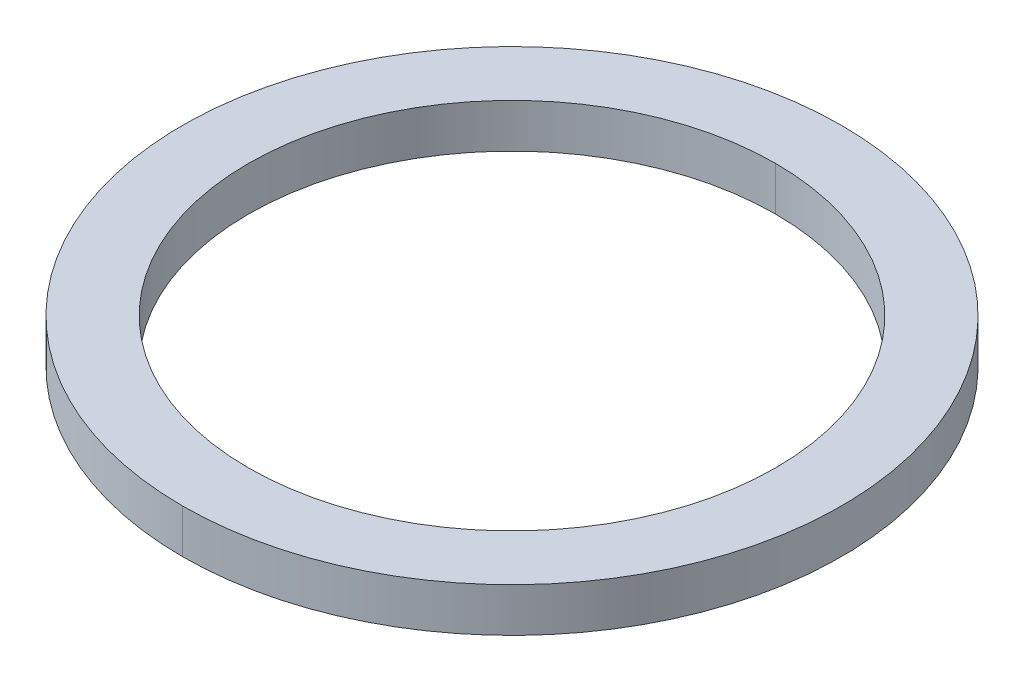
ISO-10303-21;
HEADER;
FILE_DESCRIPTION(('STEP AP214'),'2;1');
FILE_NAME('part.step','',(''),(''),'','','');
FILE_SCHEMA(('AUTOMOTIVE_DESIGN { 1 0 10303 214 1 1 1 1 }'));
ENDSEC;
DATA;
#1=APPLICATION_CONTEXT('core data for automotive mechanical design processes');
#2=APPLICATION_PROTOCOL_DEFINITION('international standard','automotive_design',2000,#1);
#3=PRODUCT_CONTEXT('',#1,'mechanical');
#4=PRODUCT('Part','Part','',(#3));
#5=PRODUCT_RELATED_PRODUCT_CATEGORY('part','',(#4));
#6=PRODUCT_DEFINITION_FORMATION('','',#4);
#7=PRODUCT_DEFINITION_CONTEXT('part definition',#1,'design');
#8=PRODUCT_DEFINITION('design','',#6,#7);
#9=PRODUCT_DEFINITION_SHAPE('','',#8);
#10=(LENGTH_UNIT() NAMED_UNIT(*) SI_UNIT(.MILLI.,.METRE.));
#11=(NAMED_UNIT(*) PLANE_ANGLE_UNIT() SI_UNIT($,.RADIAN.));
#12=(NAMED_UNIT(*) SI_UNIT($,.STERADIAN.) SOLID_ANGLE_UNIT());
#13=UNCERTAINTY_MEASURE_WITH_UNIT(LENGTH_MEASURE(1.E-05),#10,'distance_accuracy_value','');
#14=(GEOMETRIC_REPRESENTATION_CONTEXT(3) GLOBAL_UNCERTAINTY_ASSIGNED_CONTEXT((#13)) GLOBAL_UNIT_ASSIGNED_CONTEXT((#10,
#11,#12)) REPRESENTATION_CONTEXT('',''));
#15=CARTESIAN_POINT('',(0.,0.,0.));
#16=DIRECTION('',(0.,0.,1.));
#17=DIRECTION('',(1.,0.,0.));
#18=AXIS2_PLACEMENT_3D('',#15,#16,#17);
#19=CARTESIAN_POINT('',(0.,1.,0.));
#20=DIRECTION('',(0.,-1.,0.));
#21=DIRECTION('',(0.,0.,-1.));
#22=AXIS2_PLACEMENT_3D('',#19,#20,#21);
#23=CYLINDRICAL_SURFACE('',#22,6.);
#24=DIRECTION('',(0.,-1.,0.));
#25=VECTOR('',#24,1.);
#26=CARTESIAN_POINT('',(0.,1.,6.));
#27=LINE('',#26,#25);
#28=CARTESIAN_POINT('',(0.,1.,6.));
#29=VERTEX_POINT('',#28);
#30=CARTESIAN_POINT('',(0.,0.,6.));
#31=VERTEX_POINT('',#30);
#32=EDGE_CURVE('E83',#29,#31,#27,.T.);
#33=ORIENTED_EDGE('',*,*,#32,.F.);
#34=CARTESIAN_POINT('',(0.,1.,0.));
#35=DIRECTION('',(0.,1.,0.));
#36=DIRECTION('',(0.,0.,1.));
#37=AXIS2_PLACEMENT_3D('',#34,#35,#36);
#38=CIRCLE('',#37,6.);
#39=CARTESIAN_POINT('',(0.,1.,-6.));
#40=VERTEX_POINT('',#39);
#41=EDGE_CURVE('E71',#29,#40,#38,.T.);
#42=ORIENTED_EDGE('',*,*,#41,.T.);
#43=DIRECTION('',(0.,-1.,0.));
#44=VECTOR('',#43,1.);
#45=CARTESIAN_POINT('',(0.,1.,-6.));
#46=LINE('',#45,#44);
#47=CARTESIAN_POINT('',(0.,0.,-6.));
#48=VERTEX_POINT('',#47);
#49=EDGE_CURVE('E91',#40,#48,#46,.T.);
#50=ORIENTED_EDGE('',*,*,#49,.T.);
#51=CARTESIAN_POINT('',(0.,0.,0.));
#52=DIRECTION('',(0.,1.,0.));
#53=DIRECTION('',(0.,0.,1.));
#54=AXIS2_PLACEMENT_3D('',#51,#52,#53);
#55=CIRCLE('',#54,6.);
#56=EDGE_CURVE('E10',#31,#48,#55,.T.);
#57=ORIENTED_EDGE('',*,*,#56,.F.);
#58=EDGE_LOOP('',(#33,#42,#50,#57));
#59=FACE_BOUND('',#58,.T.);
#60=ADVANCED_FACE('F16',(#59),#23,.F.);
#61=CARTESIAN_POINT('',(0.,1.,0.));
#62=DIRECTION('',(0.,-1.,0.));
#63=DIRECTION('',(0.,0.,-1.));
#64=AXIS2_PLACEMENT_3D('',#61,#62,#63);
#65=CYLINDRICAL_SURFACE('',#64,7.5);
#66=DIRECTION('',(0.,-1.,0.));
#67=VECTOR('',#66,1.);
#68=CARTESIAN_POINT('',(0.,1.,7.5));
#69=LINE('',#68,#67);
#70=CARTESIAN_POINT('',(0.,1.,7.5));
#71=VERTEX_POINT('',#70);
#72=CARTESIAN_POINT('',(0.,0.,7.5));
#73=VERTEX_POINT('',#72);
#74=EDGE_CURVE('E106',#71,#73,#69,.T.);
#75=ORIENTED_EDGE('',*,*,#74,.F.);
#76=CARTESIAN_POINT('',(0.,1.,0.));
#77=DIRECTION('',(0.,1.,0.));
#78=DIRECTION('',(0.,0.,1.));
#79=AXIS2_PLACEMENT_3D('',#76,#77,#78);
#80=CIRCLE('',#79,7.5);
#81=CARTESIAN_POINT('',(0.,1.,-7.5));
#82=VERTEX_POINT('',#81);
#83=EDGE_CURVE('E19',#82,#71,#80,.T.);
#84=ORIENTED_EDGE('',*,*,#83,.F.);
#85=DIRECTION('',(0.,-1.,0.));
#86=VECTOR('',#85,1.);
#87=CARTESIAN_POINT('',(0.,1.,-7.5));
#88=LINE('',#87,#86);
#89=CARTESIAN_POINT('',(0.,0.,-7.5));
#90=VERTEX_POINT('',#89);
#91=EDGE_CURVE('E114',#82,#90,#88,.T.);
#92=ORIENTED_EDGE('',*,*,#91,.T.);
#93=CARTESIAN_POINT('',(0.,0.,0.));
#94=DIRECTION('',(0.,1.,0.));
#95=DIRECTION('',(0.,0.,1.));
#96=AXIS2_PLACEMENT_3D('',#93,#94,#95);
#97=CIRCLE('',#96,7.5);
#98=EDGE_CURVE('E25',#90,#73,#97,.T.);
#99=ORIENTED_EDGE('',*,*,#98,.T.);
#100=EDGE_LOOP('',(#75,#84,#92,#99));
#101=FACE_BOUND('',#100,.T.);
#102=ADVANCED_FACE('F124',(#101),#65,.T.);
#103=CARTESIAN_POINT('',(0.,0.,0.));
#104=DIRECTION('',(0.,1.,0.));
#105=DIRECTION('',(1.,0.,0.));
#106=AXIS2_PLACEMENT_3D('',#103,#104,#105);
#107=PLANE('',#106);
#108=CARTESIAN_POINT('',(0.,0.,0.));
#109=DIRECTION('',(0.,1.,0.));
#110=DIRECTION('',(0.,0.,1.));
#111=AXIS2_PLACEMENT_3D('',#108,#109,#110);
#112=CIRCLE('',#111,6.);
#113=EDGE_CURVE('E88',#48,#31,#112,.T.);
#114=ORIENTED_EDGE('',*,*,#113,.T.);
#115=ORIENTED_EDGE('',*,*,#56,.T.);
#116=EDGE_LOOP('',(#114,#115));
#117=FACE_BOUND('',#116,.T.);
#118=ORIENTED_EDGE('',*,*,#98,.F.);
#119=CARTESIAN_POINT('',(0.,0.,0.));
#120=DIRECTION('',(0.,1.,0.));
#121=DIRECTION('',(0.,0.,1.));
#122=AXIS2_PLACEMENT_3D('',#119,#120,#121);
#123=CIRCLE('',#122,7.5);
#124=EDGE_CURVE('E111',#73,#90,#123,.T.);
#125=ORIENTED_EDGE('',*,*,#124,.F.);
#126=EDGE_LOOP('',(#118,#125));
#127=FACE_BOUND('',#126,.T.);
#128=ADVANCED_FACE('F127',(#117,#127),#107,.F.);
#129=CARTESIAN_POINT('',(0.,1.,0.));
#130=DIRECTION('',(0.,1.,0.));
#131=DIRECTION('',(1.,0.,0.));
#132=AXIS2_PLACEMENT_3D('',#129,#130,#131);
#133=PLANE('',#132);
#134=CARTESIAN_POINT('',(0.,1.,0.));
#135=DIRECTION('',(0.,1.,0.));
#136=DIRECTION('',(0.,0.,1.));
#137=AXIS2_PLACEMENT_3D('',#134,#135,#136);
#138=CIRCLE('',#137,6.);
#139=EDGE_CURVE('E76',#40,#29,#138,.T.);
#140=ORIENTED_EDGE('',*,*,#139,.F.);
#141=ORIENTED_EDGE('',*,*,#41,.F.);
#142=EDGE_LOOP('',(#140,#141));
#143=FACE_BOUND('',#142,.T.);
#144=ORIENTED_EDGE('',*,*,#83,.T.);
#145=CARTESIAN_POINT('',(0.,1.,0.));
#146=DIRECTION('',(0.,1.,0.));
#147=DIRECTION('',(0.,0.,1.));
#148=AXIS2_PLACEMENT_3D('',#145,#146,#147);
#149=CIRCLE('',#148,7.5);
#150=EDGE_CURVE('E103',#71,#82,#149,.T.);
#151=ORIENTED_EDGE('',*,*,#150,.T.);
#152=EDGE_LOOP('',(#144,#151));
#153=FACE_BOUND('',#152,.T.);
#154=ADVANCED_FACE('F73',(#143,#153),#133,.T.);
#155=CARTESIAN_POINT('',(0.,1.,0.));
#156=DIRECTION('',(0.,-1.,0.));
#157=DIRECTION('',(0.,0.,-1.));
#158=AXIS2_PLACEMENT_3D('',#155,#156,#157);
#159=CYLINDRICAL_SURFACE('',#158,7.5);
#160=ORIENTED_EDGE('',*,*,#150,.F.);
#161=ORIENTED_EDGE('',*,*,#74,.T.);
#162=ORIENTED_EDGE('',*,*,#124,.T.);
#163=ORIENTED_EDGE('',*,*,#91,.F.);
#164=EDGE_LOOP('',(#160,#161,#162,#163));
#165=FACE_BOUND('',#164,.T.);
#166=ADVANCED_FACE('F126',(#165),#159,.T.);
#167=CARTESIAN_POINT('',(0.,1.,0.));
#168=DIRECTION('',(0.,-1.,0.));
#169=DIRECTION('',(0.,0.,-1.));
#170=AXIS2_PLACEMENT_3D('',#167,#168,#169);
#171=CYLINDRICAL_SURFACE('',#170,6.);
#172=ORIENTED_EDGE('',*,*,#139,.T.);
#173=ORIENTED_EDGE('',*,*,#32,.T.);
#174=ORIENTED_EDGE('',*,*,#113,.F.);
#175=ORIENTED_EDGE('',*,*,#49,.F.);
#176=EDGE_LOOP('',(#172,#173,#174,#175));
#177=FACE_BOUND('',#176,.T.);
#178=ADVANCED_FACE('F90',(#177),#171,.F.);
#179=CLOSED_SHELL('',(#60,#102,#128,#154,#166,#178));
#180=MANIFOLD_SOLID_BREP('B1',#179);
#181=ADVANCED_BREP_SHAPE_REPRESENTATION('',(#18,#180),#14);
#182=SHAPE_DEFINITION_REPRESENTATION(#9,#181);
ENDSEC;
END-ISO-10303-21;
